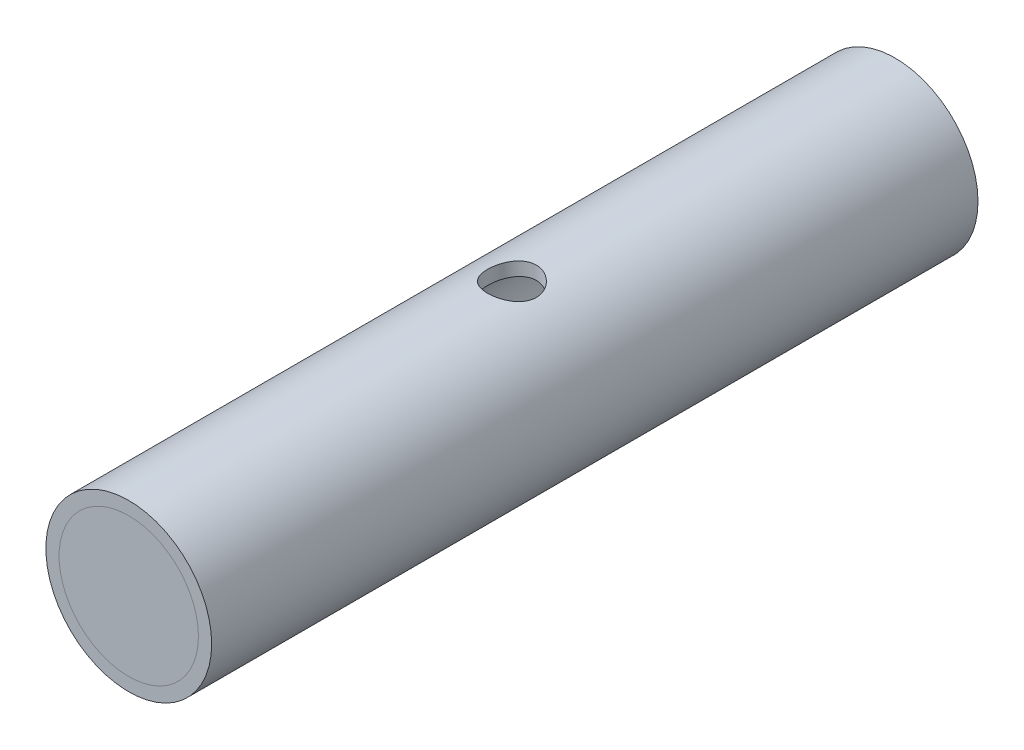
ISO-10303-21;
HEADER;
FILE_DESCRIPTION(('STEP AP214'),'2;1');
FILE_NAME('part.step','',(''),(''),'','','');
FILE_SCHEMA(('AUTOMOTIVE_DESIGN { 1 0 10303 214 1 1 1 1 }'));
ENDSEC;
DATA;
#1=APPLICATION_CONTEXT('core data for automotive mechanical design processes');
#2=APPLICATION_PROTOCOL_DEFINITION('international standard','automotive_design',2000,#1);
#3=PRODUCT_CONTEXT('',#1,'mechanical');
#4=PRODUCT('Part','Part','',(#3));
#5=PRODUCT_RELATED_PRODUCT_CATEGORY('part','',(#4));
#6=PRODUCT_DEFINITION_FORMATION('','',#4);
#7=PRODUCT_DEFINITION_CONTEXT('part definition',#1,'design');
#8=PRODUCT_DEFINITION('design','',#6,#7);
#9=PRODUCT_DEFINITION_SHAPE('','',#8);
#10=(LENGTH_UNIT() NAMED_UNIT(*) SI_UNIT(.MILLI.,.METRE.));
#11=(NAMED_UNIT(*) PLANE_ANGLE_UNIT() SI_UNIT($,.RADIAN.));
#12=(NAMED_UNIT(*) SI_UNIT($,.STERADIAN.) SOLID_ANGLE_UNIT());
#13=UNCERTAINTY_MEASURE_WITH_UNIT(LENGTH_MEASURE(1.E-05),#10,'distance_accuracy_value','');
#14=(GEOMETRIC_REPRESENTATION_CONTEXT(3) GLOBAL_UNCERTAINTY_ASSIGNED_CONTEXT((#13)) GLOBAL_UNIT_ASSIGNED_CONTEXT((#10,
#11,#12)) REPRESENTATION_CONTEXT('',''));
#15=CARTESIAN_POINT('',(0.,0.,0.));
#16=DIRECTION('',(0.,0.,1.));
#17=DIRECTION('',(1.,0.,0.));
#18=AXIS2_PLACEMENT_3D('',#15,#16,#17);
#19=CARTESIAN_POINT('',(0.,0.,-139.7));
#20=DIRECTION('',(0.,0.,1.));
#21=DIRECTION('',(1.,0.,0.));
#22=AXIS2_PLACEMENT_3D('',#19,#20,#21);
#23=PLANE('',#22);
#24=CARTESIAN_POINT('',(0.,0.,-139.7));
#25=DIRECTION('',(0.,0.,1.));
#26=DIRECTION('',(1.,0.,0.));
#27=AXIS2_PLACEMENT_3D('',#24,#25,#26);
#28=CIRCLE('',#27,25.4);
#29=CARTESIAN_POINT('',(25.4,0.,-139.7));
#30=VERTEX_POINT('',#29);
#31=EDGE_CURVE('E11',#30,#30,#28,.T.);
#32=ORIENTED_EDGE('',*,*,#31,.F.);
#33=EDGE_LOOP('',(#32));
#34=FACE_BOUND('',#33,.T.);
#35=ADVANCED_FACE('F45',(#34),#23,.F.);
#36=OPEN_SHELL('',(#35));
#37=SHELL_BASED_SURFACE_MODEL('B2',(#36));
#38=CARTESIAN_POINT('',(0.,0.,139.7));
#39=DIRECTION('',(0.,0.,1.));
#40=DIRECTION('',(1.,0.,0.));
#41=AXIS2_PLACEMENT_3D('',#38,#39,#40);
#42=PLANE('',#41);
#43=CARTESIAN_POINT('',(0.,0.,139.7));
#44=DIRECTION('',(0.,0.,1.));
#45=DIRECTION('',(1.,0.,0.));
#46=AXIS2_PLACEMENT_3D('',#43,#44,#45);
#47=CIRCLE('',#46,25.4);
#48=CARTESIAN_POINT('',(25.4,0.,139.7));
#49=VERTEX_POINT('',#48);
#50=EDGE_CURVE('E44',#49,#49,#47,.T.);
#51=ORIENTED_EDGE('',*,*,#50,.T.);
#52=EDGE_LOOP('',(#51));
#53=FACE_BOUND('',#52,.T.);
#54=ADVANCED_FACE('F70',(#53),#42,.T.);
#55=OPEN_SHELL('',(#54));
#56=SHELL_BASED_SURFACE_MODEL('B6',(#55));
#57=CARTESIAN_POINT('',(0.,0.,139.7));
#58=DIRECTION('',(0.,0.,-1.));
#59=DIRECTION('',(-1.,0.,0.));
#60=AXIS2_PLACEMENT_3D('',#57,#58,#59);
#61=CYLINDRICAL_SURFACE('',#60,30.226);
#62=CARTESIAN_POINT('',(0.,0.,139.7));
#63=DIRECTION('',(0.,0.,1.));
#64=DIRECTION('',(1.,0.,0.));
#65=AXIS2_PLACEMENT_3D('',#62,#63,#64);
#66=CIRCLE('',#65,30.226);
#67=CARTESIAN_POINT('',(30.226,0.,139.7));
#68=VERTEX_POINT('',#67);
#69=EDGE_CURVE('E69',#68,#68,#66,.T.);
#70=ORIENTED_EDGE('',*,*,#69,.F.);
#71=EDGE_LOOP('',(#70));
#72=FACE_BOUND('',#71,.T.);
#73=CARTESIAN_POINT('',(0.,0.,-139.7));
#74=DIRECTION('',(0.,0.,1.));
#75=DIRECTION('',(1.,0.,0.));
#76=AXIS2_PLACEMENT_3D('',#73,#74,#75);
#77=CIRCLE('',#76,30.226);
#78=CARTESIAN_POINT('',(30.226,0.,-139.7));
#79=VERTEX_POINT('',#78);
#80=EDGE_CURVE('E99',#79,#79,#77,.T.);
#81=ORIENTED_EDGE('',*,*,#80,.T.);
#82=EDGE_LOOP('',(#81));
#83=FACE_BOUND('',#82,.T.);
#84=CARTESIAN_POINT('',(0.,30.226,-8.89));
#85=CARTESIAN_POINT('',(0.244078706479912,30.2259996469876,-8.8899994428249));
#86=CARTESIAN_POINT('',(0.488167387654134,30.2230364699701,-8.87993976396791));
#87=CARTESIAN_POINT('',(0.97455598982904,30.2112645876433,-8.83979049136477));
#88=CARTESIAN_POINT('',(1.21685581274789,30.2024555641822,-8.80969980745906));
#89=CARTESIAN_POINT('',(1.69792260983485,30.1792334713529,-8.72975476642686));
#90=CARTESIAN_POINT('',(1.93668923426588,30.1648198510094,-8.67989846617793));
#91=CARTESIAN_POINT('',(2.40905708817351,30.1307752858961,-8.5608349553122));
#92=CARTESIAN_POINT('',(2.642656372997,30.111142411939,-8.49162058890068));
#93=CARTESIAN_POINT('',(3.10256853763941,30.0672315681266,-8.33457300681144));
#94=CARTESIAN_POINT('',(3.32889408019572,30.042962245951,-8.24677442111533));
#95=CARTESIAN_POINT('',(3.77330293959243,29.990387664788,-8.05313961246428));
#96=CARTESIAN_POINT('',(3.99138312088059,29.9620808895808,-7.94729661020325));
#97=CARTESIAN_POINT('',(4.4177585595968,29.902187586809,-7.71842189243786));
#98=CARTESIAN_POINT('',(4.62605700744133,29.8706021395618,-7.59539583413605));
#99=CARTESIAN_POINT('',(5.03176128322064,29.8049443588251,-7.33293112769926));
#100=CARTESIAN_POINT('',(5.22916205908566,29.7708708886305,-7.19348495964529));
#101=CARTESIAN_POINT('',(5.61656331398885,29.7002529351966,-6.89547090415772));
#102=CARTESIAN_POINT('',(5.80625628386527,29.6636680114812,-6.73651274297299));
#103=CARTESIAN_POINT('',(6.17158614178702,29.5898179182596,-6.40349071346725));
#104=CARTESIAN_POINT('',(6.34722892320604,29.5525530421013,-6.2294332431147));
#105=CARTESIAN_POINT('',(6.68353714076706,29.4783154913867,-5.86715866551885));
#106=CARTESIAN_POINT('',(6.84419410921452,29.4413429927062,-5.67893366018102));
#107=CARTESIAN_POINT('',(7.14931677644756,29.3687408118013,-5.28966028347711));
#108=CARTESIAN_POINT('',(7.29378848008797,29.3331106348434,-5.08861671162439));
#109=CARTESIAN_POINT('',(7.56861071639277,29.263420012929,-4.670354516169));
#110=CARTESIAN_POINT('',(7.69858197558977,29.2294111454195,-4.45287781877845));
#111=CARTESIAN_POINT('',(7.93962896840895,29.1648579438805,-4.00730885066998));
#112=CARTESIAN_POINT('',(8.05071207630933,29.1343122593206,-3.77922076733142));
#113=CARTESIAN_POINT('',(8.25314907578469,29.0776144871262,-3.31391052520422));
#114=CARTESIAN_POINT('',(8.34450246281639,29.0514625118547,-3.07668813300891));
#115=CARTESIAN_POINT('',(8.50668060363154,29.0043893315501,-2.59482218272546));
#116=CARTESIAN_POINT('',(8.57750605749935,28.9834679481362,-2.35017887803443));
#117=CARTESIAN_POINT('',(8.69634890089307,28.9480281625952,-1.86199183429746));
#118=CARTESIAN_POINT('',(8.74493072550874,28.9333520624647,-1.61859691092543));
#119=CARTESIAN_POINT('',(8.82159698086839,28.9100694160743,-1.12831123119266));
#120=CARTESIAN_POINT('',(8.84968174946794,28.9014627697708,-0.881420532521621));
#121=CARTESIAN_POINT('',(8.88508300299209,28.8905991693422,-0.386064842964374));
#122=CARTESIAN_POINT('',(8.89240366742803,28.8883409373746,-0.137600178987127));
#123=CARTESIAN_POINT('',(8.88621729725737,28.8902445472134,0.359042257596101));
#124=CARTESIAN_POINT('',(8.87271069032239,28.8944062571913,0.607220035988328));
#125=CARTESIAN_POINT('',(8.82583332459631,28.9087584068174,1.09278404914752));
#126=CARTESIAN_POINT('',(8.79316996174973,28.9187340776159,1.33024534915828));
#127=CARTESIAN_POINT('',(8.70883701542997,28.9442424771791,1.80155154360951));
#128=CARTESIAN_POINT('',(8.65716065024015,28.9597771887347,2.03539511659759));
#129=CARTESIAN_POINT('',(8.53525057637777,28.9959412540276,2.49774906986565));
#130=CARTESIAN_POINT('',(8.46501951874038,29.0165698799351,2.72626020695498));
#131=CARTESIAN_POINT('',(8.30655922248898,29.0623286163258,3.17649732891058));
#132=CARTESIAN_POINT('',(8.21832901198872,29.0874589698762,3.39822294664065));
#133=CARTESIAN_POINT('',(8.02325989862576,29.1418729451168,3.83636063428442));
#134=CARTESIAN_POINT('',(7.91619048736205,29.171207064159,4.05266376247001));
#135=CARTESIAN_POINT('',(7.68504145398429,29.2329525986027,4.47552255775782));
#136=CARTESIAN_POINT('',(7.56096136815434,29.2653640978871,4.68207795892776));
#137=CARTESIAN_POINT('',(7.29661542062856,29.3323894086294,5.08423208979507));
#138=CARTESIAN_POINT('',(7.15634660791665,29.3670036210987,5.2798288121696));
#139=CARTESIAN_POINT('',(6.86054325837309,29.4375123830306,5.65887305215183));
#140=CARTESIAN_POINT('',(6.70500830101903,29.4734069677452,5.84232023485412));
#141=CARTESIAN_POINT('',(6.37309948147162,29.5469915803686,6.20307678651097));
#142=CARTESIAN_POINT('',(6.19614005266523,29.5846958830333,6.37984497369451));
#143=CARTESIAN_POINT('',(5.82788473386927,29.6594357414022,6.7179116255409));
#144=CARTESIAN_POINT('',(5.63658880673348,29.6964712953733,6.87921005011872));
#145=CARTESIAN_POINT('',(5.24085978194455,29.768858235539,7.18526691140944));
#146=CARTESIAN_POINT('',(5.03642540015524,29.8042094565191,7.33002372751317));
#147=CARTESIAN_POINT('',(4.61576143173586,29.8722481575714,7.60194497599365));
#148=CARTESIAN_POINT('',(4.39953234469629,29.9049357503212,7.72911015269717));
#149=CARTESIAN_POINT('',(3.95525530679247,29.9669427009477,7.9656636880869));
#150=CARTESIAN_POINT('',(3.72713969660147,29.9962387958717,8.07493118427459));
#151=CARTESIAN_POINT('',(3.26206631148383,30.0503706287545,8.27375070109574));
#152=CARTESIAN_POINT('',(3.02511214884852,30.0752081653044,8.36331067508901));
#153=CARTESIAN_POINT('',(2.54398303202942,30.1197208813725,8.52199592177024));
#154=CARTESIAN_POINT('',(2.29980815740385,30.1393961177457,8.59112141951418));
#155=CARTESIAN_POINT('',(1.80606843050216,30.1730079252525,8.70830566479437));
#156=CARTESIAN_POINT('',(1.55650376707305,30.1869446971077,8.75636514918747));
#157=CARTESIAN_POINT('',(1.06261968213193,30.2082916354644,8.8296710562624));
#158=CARTESIAN_POINT('',(0.818417757186319,30.2159110364993,8.85564962120586));
#159=CARTESIAN_POINT('',(0.328590892209214,30.2252063849922,8.88731436901833));
#160=CARTESIAN_POINT('',(0.0829659851694474,30.2268824696974,8.89300102048285));
#161=CARTESIAN_POINT('',(-0.40784987281736,30.224244521121,8.88403052193145));
#162=CARTESIAN_POINT('',(-0.653040870736351,30.2199311816881,8.86937572838384));
#163=CARTESIAN_POINT('',(-1.1411968409233,30.2054361323306,8.81986142402252));
#164=CARTESIAN_POINT('',(-1.38416182792222,30.1952544612691,8.78500204701391));
#165=CARTESIAN_POINT('',(-1.86083203051031,30.169589165289,8.69637213218624));
#166=CARTESIAN_POINT('',(-2.09462365098016,30.1542259248426,8.64303029318015));
#167=CARTESIAN_POINT('',(-2.55686793973268,30.1185534203235,8.51773967757665));
#168=CARTESIAN_POINT('',(-2.78531866058363,30.0982423820557,8.44578422588438));
#169=CARTESIAN_POINT('',(-3.2352224337486,30.0532113739645,8.28387461512614));
#170=CARTESIAN_POINT('',(-3.45667746412433,30.0284926638052,8.19392559753113));
#171=CARTESIAN_POINT('',(-3.89133643186513,29.9752655168102,7.99666092040893));
#172=CARTESIAN_POINT('',(-4.10453716985472,29.9467556291252,7.88933860884483));
#173=CARTESIAN_POINT('',(-4.52590677767711,29.886009333503,7.65555975084611));
#174=CARTESIAN_POINT('',(-4.73386016838861,29.85370446917,7.52873261033239));
#175=CARTESIAN_POINT('',(-5.13849590409138,29.7867255225319,7.25859255660919));
#176=CARTESIAN_POINT('',(-5.33517312906508,29.7520503794079,7.11527224200254));
#177=CARTESIAN_POINT('',(-5.7159635149058,29.6812457002579,6.81314399520717));
#178=CARTESIAN_POINT('',(-5.90007679207984,29.6451161777003,6.6543362064222));
#179=CARTESIAN_POINT('',(-6.25463251854174,29.5723419371038,6.32223659129286));
#180=CARTESIAN_POINT('',(-6.4250747193106,29.5356972097136,6.14894450176321));
#181=CARTESIAN_POINT('',(-6.75696661742502,29.4615749720045,5.78262113048179));
#182=CARTESIAN_POINT('',(-6.917891650935,29.4241132980724,5.58911084793865));
#183=CARTESIAN_POINT('',(-7.22283084055437,29.3507475815498,5.18903219372249));
#184=CARTESIAN_POINT('',(-7.36685115519356,29.3148429747312,4.9824686199264));
#185=CARTESIAN_POINT('',(-7.63707984287791,29.2456074904237,4.55747134911744));
#186=CARTESIAN_POINT('',(-7.76328126495719,29.212277619596,4.33903306567023));
#187=CARTESIAN_POINT('',(-7.9968003514047,29.149217661518,3.89189807597559));
#188=CARTESIAN_POINT('',(-8.10412578091448,29.1194860955864,3.66320563686504));
#189=CARTESIAN_POINT('',(-8.29861808844121,29.0646551949032,3.19816412733975));
#190=CARTESIAN_POINT('',(-8.38587905379894,29.0395343561179,2.96185697437128));
#191=CARTESIAN_POINT('',(-8.54014663565491,28.9945414818076,2.48222737104045));
#192=CARTESIAN_POINT('',(-8.60715324622509,28.9746694478189,2.23890491862487));
#193=CARTESIAN_POINT('',(-8.72028277188292,28.9408229962171,1.74711578424973));
#194=CARTESIAN_POINT('',(-8.7664113902741,28.9268469680454,1.49865052658366));
#195=CARTESIAN_POINT('',(-8.8373668942041,28.9052487411391,0.998425786102343));
#196=CARTESIAN_POINT('',(-8.86219455076498,28.8976263124262,0.746666422857382));
#197=CARTESIAN_POINT('',(-8.88974195465115,28.8891633127108,0.251958860700056));
#198=CARTESIAN_POINT('',(-8.89330769628549,28.8880632331827,0.00906182099380927));
#199=CARTESIAN_POINT('',(-8.88055579708614,28.8919859232674,-0.476155515219273));
#200=CARTESIAN_POINT('',(-8.86423871478479,28.8970085208868,-0.718475827735477));
#201=CARTESIAN_POINT('',(-8.8118730618851,28.9130198172743,-1.20076164026306));
#202=CARTESIAN_POINT('',(-8.7758253365073,28.9240082604776,-1.44072724069731));
#203=CARTESIAN_POINT('',(-8.68432270563806,28.9516129832692,-1.91659763878378));
#204=CARTESIAN_POINT('',(-8.62886770733465,28.9682292897718,-2.15250241701016));
#205=CARTESIAN_POINT('',(-8.49978992758467,29.0063633559375,-2.61588258729795));
#206=CARTESIAN_POINT('',(-8.42638725512145,29.0278215063077,-2.84342430339863));
#207=CARTESIAN_POINT('',(-8.26165142611859,29.0751359827725,-3.29153820520311));
#208=CARTESIAN_POINT('',(-8.1703118460547,29.1009938840516,-3.51210786113927));
#209=CARTESIAN_POINT('',(-7.97041080925797,29.1563779786197,-3.94479982002137));
#210=CARTESIAN_POINT('',(-7.86185034442111,29.1859039606118,-4.15692260861382));
#211=CARTESIAN_POINT('',(-7.62826213845604,29.247825333984,-4.57146872475367));
#212=CARTESIAN_POINT('',(-7.50323343985708,29.2802208921668,-4.77389148740309));
#213=CARTESIAN_POINT('',(-7.23286117469694,29.3482009035,-5.17477601973064));
#214=CARTESIAN_POINT('',(-7.08695786849174,29.3838574325532,-5.37284822927006));
#215=CARTESIAN_POINT('',(-6.77936450740341,29.4563448764872,-5.75610067742786));
#216=CARTESIAN_POINT('',(-6.61767412950644,29.4931758153869,-5.9412806521298));
#217=CARTESIAN_POINT('',(-6.27949627694084,29.5670248235009,-6.29764885621711));
#218=CARTESIAN_POINT('',(-6.10300506223222,29.6040429377787,-6.46883352740131));
#219=CARTESIAN_POINT('',(-5.73636337559087,29.6772665872085,-6.79607336987705));
#220=CARTESIAN_POINT('',(-5.54621315315061,29.7134721371869,-6.95212881739343));
#221=CARTESIAN_POINT('',(-5.14791894750998,29.7850982086146,-7.25223620730231));
#222=CARTESIAN_POINT('',(-4.9394203096772,29.8204683996658,-7.39582996629549));
#223=CARTESIAN_POINT('',(-4.51067392816381,29.8883251144409,-7.66485125686286));
#224=CARTESIAN_POINT('',(-4.29043049364585,29.9208126843012,-7.79028538929844));
#225=CARTESIAN_POINT('',(-3.83966688283158,29.9819904289941,-8.02204893102891));
#226=CARTESIAN_POINT('',(-3.60914909312285,30.0106814796222,-8.12838274848758));
#227=CARTESIAN_POINT('',(-3.13941870197074,30.0634488654799,-8.32109240173994));
#228=CARTESIAN_POINT('',(-2.90020700459871,30.0875256789153,-8.40747030589706));
#229=CARTESIAN_POINT('',(-2.4434211158612,30.1278441129275,-8.55056411707888));
#230=CARTESIAN_POINT('',(-2.2266145222584,30.1446744215742,-8.60957474760697));
#231=CARTESIAN_POINT('',(-1.78878870356977,30.1738205938962,-8.71107584452359));
#232=CARTESIAN_POINT('',(-1.56776818885476,30.1861350514291,-8.753561165523));
#233=CARTESIAN_POINT('',(-1.12295612449701,30.2059530617643,-8.82166010393837));
#234=CARTESIAN_POINT('',(-0.899164920398878,30.2134572084417,-8.84727580406777));
#235=CARTESIAN_POINT('',(-0.45025165590039,30.2234799980885,-8.88144312616897));
#236=CARTESIAN_POINT('',(-0.225130070987301,30.2260003256068,-8.89000051391975));
#237=CARTESIAN_POINT('',(0.,30.226,-8.89));
#238=B_SPLINE_CURVE_WITH_KNOTS('',3,(#84,#85,#86,#87,#88,#89,#90,#91,#92,#93,#94,#95,#96,#97,
#98,#99,#100,#101,#102,#103,#104,#105,#106,#107,#108,#109,#110,#111,#112,#113,#114,#115,#116,
#117,#118,#119,#120,#121,#122,#123,#124,#125,#126,#127,#128,#129,#130,#131,#132,#133,#134,#135,
#136,#137,#138,#139,#140,#141,#142,#143,#144,#145,#146,#147,#148,#149,#150,#151,#152,#153,#154,
#155,#156,#157,#158,#159,#160,#161,#162,#163,#164,#165,#166,#167,#168,#169,#170,#171,#172,#173,
#174,#175,#176,#177,#178,#179,#180,#181,#182,#183,#184,#185,#186,#187,#188,#189,#190,#191,#192,
#193,#194,#195,#196,#197,#198,#199,#200,#201,#202,#203,#204,#205,#206,#207,#208,#209,#210,#211,
#212,#213,#214,#215,#216,#217,#218,#219,#220,#221,#222,#223,#224,#225,#226,#227,#228,#229,#230,
#231,#232,#233,#234,#235,#236,#237),.UNSPECIFIED.,.T.,.F.,(4,2,2,2,2,2,2,2,2,2,2,2,2,2,2,2,2,2,
2,2,2,2,2,2,2,2,2,2,2,2,2,2,2,2,2,2,2,2,2,2,2,2,2,2,2,2,2,2,2,2,2,2,2,2,2,2,2,2,2,2,2,2,2,2,2,2,
2,2,2,2,2,2,2,2,2,2,4),(0.,0.732029116388138,1.46409807569938,2.19623902125549,2.92865096446526,
3.65970995467328,4.39104421223776,5.12213825664933,5.85356843208124,6.60324733583172,
7.3526101184803,8.1023937936703,8.85189836576199,9.61784382824925,10.3834895616184,
11.1491548723388,11.9147940677462,12.6597509573845,13.4046955675267,14.1494902205382,
14.8942695799808,15.6131389798596,16.332265041063,17.0512884113462,17.7703506164558,
18.4989153488715,19.2274999461236,19.9562175662474,20.68495526532,21.4429178113364,
22.2008823213207,22.9589210268095,23.7169276488077,24.4798589907271,25.2424818696414,
26.0050963490633,26.7676841512706,27.5038729056716,28.2400446593604,28.9761311378565,
29.712212741666,30.4322524884544,31.1525508101304,31.872643607423,32.5930127750596,
33.3293093492264,34.06593763832,34.8025591073711,35.5391939640269,36.3016509651392,
37.0638293289829,37.826304194128,38.5884646575372,39.3469747562069,40.1054850768776,
40.8637880677715,41.6220636095297,42.3499552842775,43.0778265121479,43.8056665619384,
44.5335100925475,45.2528395482285,45.9724270798541,46.691973179405,47.4115611321817,
48.1564518310487,48.9013577740633,49.646452518668,50.3915336569932,51.1574676474499,
51.923122524964,52.6886004692291,53.4539990386454,54.1292999722274,54.804811002323,
55.4802386185824,56.1554378988228),.UNSPECIFIED.);
#239=CARTESIAN_POINT('',(0.,30.226,-8.89));
#240=VERTEX_POINT('',#239);
#241=EDGE_CURVE('E111',#240,#240,#238,.T.);
#242=ORIENTED_EDGE('',*,*,#241,.T.);
#243=EDGE_LOOP('',(#242));
#244=FACE_BOUND('',#243,.T.);
#245=ADVANCED_FACE('F88',(#72,#83,#244),#61,.T.);
#246=CARTESIAN_POINT('',(0.,0.,139.7));
#247=DIRECTION('',(0.,0.,-1.));
#248=DIRECTION('',(-1.,0.,0.));
#249=AXIS2_PLACEMENT_3D('',#246,#247,#248);
#250=CYLINDRICAL_SURFACE('',#249,25.4);
#251=CARTESIAN_POINT('',(0.,0.,-139.7));
#252=DIRECTION('',(0.,0.,1.));
#253=DIRECTION('',(1.,0.,0.));
#254=AXIS2_PLACEMENT_3D('',#251,#252,#253);
#255=CIRCLE('',#254,25.4);
#256=CARTESIAN_POINT('',(25.4,0.,-139.7));
#257=VERTEX_POINT('',#256);
#258=EDGE_CURVE('E106',#257,#257,#255,.T.);
#259=ORIENTED_EDGE('',*,*,#258,.F.);
#260=EDGE_LOOP('',(#259));
#261=FACE_BOUND('',#260,.T.);
#262=CARTESIAN_POINT('',(0.,0.,139.7));
#263=DIRECTION('',(0.,0.,1.));
#264=DIRECTION('',(1.,0.,0.));
#265=AXIS2_PLACEMENT_3D('',#262,#263,#264);
#266=CIRCLE('',#265,25.4);
#267=CARTESIAN_POINT('',(25.4,0.,139.7));
#268=VERTEX_POINT('',#267);
#269=EDGE_CURVE('E104',#268,#268,#266,.T.);
#270=ORIENTED_EDGE('',*,*,#269,.T.);
#271=EDGE_LOOP('',(#270));
#272=FACE_BOUND('',#271,.T.);
#273=CARTESIAN_POINT('',(0.,25.4,-8.89));
#274=CARTESIAN_POINT('',(-0.24182836127676,25.4000003228687,-8.89000046066678));
#275=CARTESIAN_POINT('',(-0.483649910766547,25.3965386751855,-8.88012480972059));
#276=CARTESIAN_POINT('',(-0.965483039129618,25.3827879616841,-8.84072205756583));
#277=CARTESIAN_POINT('',(-1.20549468558075,25.3724991520666,-8.8111956937832));
#278=CARTESIAN_POINT('',(-1.68194910026183,25.3453741117162,-8.73277957937956));
#279=CARTESIAN_POINT('',(-1.91839191607314,25.3285379683557,-8.68389008715417));
#280=CARTESIAN_POINT('',(-2.38603889349826,25.2887700932736,-8.56720481739291));
#281=CARTESIAN_POINT('',(-2.61724297957594,25.2658382737203,-8.49940876743478));
#282=CARTESIAN_POINT('',(-3.0723826494721,25.2145357382167,-8.34566648981001));
#283=CARTESIAN_POINT('',(-3.29633190472679,25.1861760434604,-8.25975700579726));
#284=CARTESIAN_POINT('',(-3.73609519702151,25.124707163568,-8.07037982977754));
#285=CARTESIAN_POINT('',(-3.9519061844539,25.0915962199228,-7.96690563419961));
#286=CARTESIAN_POINT('',(-4.37398916001867,25.0214706063928,-7.74321424806668));
#287=CARTESIAN_POINT('',(-4.58026146881424,24.9844560678731,-7.62299762089035));
#288=CARTESIAN_POINT('',(-4.98209472134935,24.9074405095819,-7.36665694795064));
#289=CARTESIAN_POINT('',(-5.17765498194656,24.8674392997241,-7.23053188938523));
#290=CARTESIAN_POINT('',(-5.56341369095874,24.784040913989,-6.93837452809234));
#291=CARTESIAN_POINT('',(-5.75320395213842,24.7405745232637,-6.78182284355986));
#292=CARTESIAN_POINT('',(-6.11904149675278,24.6526414886776,-6.45366687164949));
#293=CARTESIAN_POINT('',(-6.29508853312742,24.6081748268536,-6.28206231378591));
#294=CARTESIAN_POINT('',(-6.63243852095564,24.519404436464,-5.92479822732127));
#295=CARTESIAN_POINT('',(-6.79373765949196,24.4751007528603,-5.73913508657304));
#296=CARTESIAN_POINT('',(-7.10053992515739,24.3878611958871,-5.35489260406743));
#297=CARTESIAN_POINT('',(-7.24604344780902,24.3449252882875,-5.15631358592307));
#298=CARTESIAN_POINT('',(-7.52477666145232,24.2602482596366,-4.74072321063943));
#299=CARTESIAN_POINT('',(-7.65745167312731,24.2185917039722,-4.52332202199023));
#300=CARTESIAN_POINT('',(-7.90387858032243,24.1392928728523,-4.07745705638203));
#301=CARTESIAN_POINT('',(-8.01763799103598,24.1016490052944,-3.84899771964204));
#302=CARTESIAN_POINT('',(-8.22533529974016,24.0315600989627,-3.38247645065934));
#303=CARTESIAN_POINT('',(-8.31927427082587,23.9991147787582,-3.14441503911262));
#304=CARTESIAN_POINT('',(-8.48646055694893,23.9405063805822,-2.66038270925555));
#305=CARTESIAN_POINT('',(-8.5597089108455,23.9143429872101,-2.41441218874614));
#306=CARTESIAN_POINT('',(-8.68248344274812,23.8700353031105,-1.92555221296121));
#307=CARTESIAN_POINT('',(-8.73277986901461,23.8516325150532,-1.68287959449671));
#308=CARTESIAN_POINT('',(-8.81297254646513,23.8221188810588,-1.19374554183842));
#309=CARTESIAN_POINT('',(-8.84286926059784,23.8110078696431,-0.947284193755405));
#310=CARTESIAN_POINT('',(-8.88193828675368,23.7964621052267,-0.452572018250616));
#311=CARTESIAN_POINT('',(-8.89111681440155,23.7930250499799,-0.204321749947242));
#312=CARTESIAN_POINT('',(-8.88866671739678,23.7939405768778,0.292057504998741));
#313=CARTESIAN_POINT('',(-8.87703876086258,23.7982929088968,0.540186495279796));
#314=CARTESIAN_POINT('',(-8.83423484632625,23.8142137466371,1.02165481790422));
#315=CARTESIAN_POINT('',(-8.80409277306774,23.825400434615,1.25509961868142));
#316=CARTESIAN_POINT('',(-8.72547605988569,23.8543040164729,1.71855411648044));
#317=CARTESIAN_POINT('',(-8.67699497569773,23.8720232057953,1.94856257641647));
#318=CARTESIAN_POINT('',(-8.56215904396402,23.9134512471228,2.40344485562842));
#319=CARTESIAN_POINT('',(-8.4958092116553,23.9371584183601,2.62832009646765));
#320=CARTESIAN_POINT('',(-8.345766652109,23.9898832431993,3.07165555571933));
#321=CARTESIAN_POINT('',(-8.26206731960872,24.0189029188729,3.29011329460321));
#322=CARTESIAN_POINT('',(-8.07644310233061,24.0819606875936,3.72283849180864));
#323=CARTESIAN_POINT('',(-7.97423447133549,24.1160752091097,3.93697301133352));
#324=CARTESIAN_POINT('',(-7.75329966938953,24.1880102273709,4.35598001285756));
#325=CARTESIAN_POINT('',(-7.63456786619877,24.2258319864938,4.56084930494186));
#326=CARTESIAN_POINT('',(-7.38140498168582,24.3041645048159,4.96012540526309));
#327=CARTESIAN_POINT('',(-7.24697254199541,24.3446754965478,5.15453130611257));
#328=CARTESIAN_POINT('',(-6.96325053839514,24.4273406603556,5.5318132515891));
#329=CARTESIAN_POINT('',(-6.81396039275777,24.4694948967305,5.7146888443088));
#330=CARTESIAN_POINT('',(-6.49229083591047,24.5568629733031,6.07820163967571));
#331=CARTESIAN_POINT('',(-6.31907346110122,24.6021121444069,6.25808974216942));
#332=CARTESIAN_POINT('',(-5.95810424454161,24.6920143575725,6.60267647095273));
#333=CARTESIAN_POINT('',(-5.7703569355752,24.7366675804914,6.76737979945686));
#334=CARTESIAN_POINT('',(-5.38131687778199,24.8242058093451,7.08067317463898));
#335=CARTESIAN_POINT('',(-5.1800174503464,24.8670899264097,7.22925518098298));
#336=CARTESIAN_POINT('',(-4.76526877459592,24.9498879216856,7.50911928552187));
#337=CARTESIAN_POINT('',(-4.55182439765147,24.9898029761785,7.64040825092488));
#338=CARTESIAN_POINT('',(-4.11133665081266,25.066062294242,7.88628006939207));
#339=CARTESIAN_POINT('',(-3.8841574552371,25.1023561331244,8.00063553790658));
#340=CARTESIAN_POINT('',(-3.42028129129789,25.1697551674433,8.20965670536595));
#341=CARTESIAN_POINT('',(-3.18358833273178,25.2008625209675,8.30433059784984));
#342=CARTESIAN_POINT('',(-2.70231577010806,25.2570024059238,8.47317019639736));
#343=CARTESIAN_POINT('',(-2.45773692595574,25.2820355207157,8.54733787193962));
#344=CARTESIAN_POINT('',(-1.96253480644617,25.3252880383655,8.67443897636092));
#345=CARTESIAN_POINT('',(-1.7119118418047,25.3435077906929,8.72737349433645));
#346=CARTESIAN_POINT('',(-1.21856085419909,25.3718988595058,8.80946988267054));
#347=CARTESIAN_POINT('',(-0.976019201388801,25.3824097376397,8.83963668204542));
#348=CARTESIAN_POINT('',(-0.489076510216546,25.3964588452306,8.87989758260712));
#349=CARTESIAN_POINT('',(-0.244675530714951,25.399997294498,8.88999231657934));
#350=CARTESIAN_POINT('',(0.244084729546523,25.4000027020732,8.89000767363187));
#351=CARTESIAN_POINT('',(0.488444010441736,25.3964708433876,8.87993167168757));
#352=CARTESIAN_POINT('',(0.975300924814962,25.3824366947288,8.83971422670889));
#353=CARTESIAN_POINT('',(1.21779858050512,25.3719344880541,8.80957302346173));
#354=CARTESIAN_POINT('',(1.69121613557356,25.3447067158221,8.73084022637263));
#355=CARTESIAN_POINT('',(1.92225490463188,25.3281965624366,8.68288619494138));
#356=CARTESIAN_POINT('',(2.3794116197627,25.2893464945036,8.56889820899747));
#357=CARTESIAN_POINT('',(2.60552779193171,25.2670045148806,8.50285784962736));
#358=CARTESIAN_POINT('',(3.05122307878095,25.2170639583819,8.35328552874066));
#359=CARTESIAN_POINT('',(3.27080400775923,25.1894668564608,8.26975847456052));
#360=CARTESIAN_POINT('',(3.70222474223599,25.1296832761152,8.08582986894795));
#361=CARTESIAN_POINT('',(3.91406157862406,25.0974950601527,7.98542192624749));
#362=CARTESIAN_POINT('',(4.33433601334893,25.0283861807437,7.76552655216419));
#363=CARTESIAN_POINT('',(4.54252287397827,24.9913602993818,7.64559303050845));
#364=CARTESIAN_POINT('',(4.94817757016623,24.9142165943069,7.38953267861459));
#365=CARTESIAN_POINT('',(5.14564168045934,24.874097707597,7.2534002723674));
#366=CARTESIAN_POINT('',(5.52868238891824,24.7917739314876,6.9658544782867));
#367=CARTESIAN_POINT('',(5.71425758237119,24.7495687966313,6.8144392901679));
#368=CARTESIAN_POINT('',(6.07246591542535,24.6641251473516,6.49726793267772));
#369=CARTESIAN_POINT('',(6.24509866521659,24.620886601855,6.33151133168481));
#370=CARTESIAN_POINT('',(6.58483651179129,24.5322703529644,5.97788789061661));
#371=CARTESIAN_POINT('',(6.75122048291735,24.4868950584648,5.7893268026792));
#372=CARTESIAN_POINT('',(7.06750806840006,24.3974863043549,5.39866413540737));
#373=CARTESIAN_POINT('',(7.2174170670032,24.3534524097777,5.19656701479391));
#374=CARTESIAN_POINT('',(7.49985818734934,24.2679606620271,4.7799157871424));
#375=CARTESIAN_POINT('',(7.63238252053396,24.2265039678195,4.56535615842288));
#376=CARTESIAN_POINT('',(7.87893496742905,24.1474459410819,4.12529570442282));
#377=CARTESIAN_POINT('',(7.99297082473854,24.1098429969114,3.89979951142456));
#378=CARTESIAN_POINT('',(8.20173163791441,24.0396285698582,3.43913856970451));
#379=CARTESIAN_POINT('',(8.29644671668867,24.0070196421091,3.20396894921907));
#380=CARTESIAN_POINT('',(8.46559774464417,23.9478952831017,2.72580891279483));
#381=CARTESIAN_POINT('',(8.54004250954482,23.9213772036729,2.48282194825808));
#382=CARTESIAN_POINT('',(8.66795623370348,23.875325394405,1.99078724971406));
#383=CARTESIAN_POINT('',(8.72142958633079,23.8557902017742,1.74174079675165));
#384=CARTESIAN_POINT('',(8.80684895534407,23.8243886084327,1.23950917039701));
#385=CARTESIAN_POINT('',(8.8387962110462,23.8125217662359,0.986324236128201));
#386=CARTESIAN_POINT('',(8.87962241707451,23.7973264159497,0.492272408418115));
#387=CARTESIAN_POINT('',(8.88970267173595,23.7935534002801,0.251517715589925));
#388=CARTESIAN_POINT('',(8.89028432379948,23.7933362064393,-0.23001332013789));
#389=CARTESIAN_POINT('',(8.8807864931642,23.7968917393039,-0.470789661809579));
#390=CARTESIAN_POINT('',(8.84231184142958,23.8112145601791,-0.950542608328767));
#391=CARTESIAN_POINT('',(8.81333643460381,23.8219813245797,-1.1895193425725));
#392=CARTESIAN_POINT('',(8.73619856388598,23.8503777668466,-1.66393844348224));
#393=CARTESIAN_POINT('',(8.68803606226916,23.8680074582066,-1.89938080319818));
#394=CARTESIAN_POINT('',(8.57433202644246,23.9090859074155,-2.35961897797444));
#395=CARTESIAN_POINT('',(8.50922313637722,23.9323889801715,-2.58453501079215));
#396=CARTESIAN_POINT('',(8.36167508714692,23.9843387162895,-3.0280573616841));
#397=CARTESIAN_POINT('',(8.27922978077695,24.0129872746647,-3.24666141027998));
#398=CARTESIAN_POINT('',(8.09768868010847,24.0748130685541,-3.67612283653873));
#399=CARTESIAN_POINT('',(7.9985959703219,24.1079894649152,-3.88698164047437));
#400=CARTESIAN_POINT('',(7.78442314190305,24.1779951238205,-4.29988025615374));
#401=CARTESIAN_POINT('',(7.66933684070769,24.214825797398,-4.50191661756557));
#402=CARTESIAN_POINT('',(7.41821286470413,24.2929661492734,-4.90522757128897));
#403=CARTESIAN_POINT('',(7.28144658984322,24.3344047914034,-5.1060237294263));
#404=CARTESIAN_POINT('',(6.99209466758942,24.4191183630589,-5.49559973059913));
#405=CARTESIAN_POINT('',(6.83950184292963,24.4623941204062,-5.68437405860483));
#406=CARTESIAN_POINT('',(6.51947673745576,24.5496216643878,-6.04874535989732));
#407=CARTESIAN_POINT('',(6.35204365352524,24.5935734875026,-6.2243416190703));
#408=CARTESIAN_POINT('',(6.00332687565089,24.681012447743,-6.56132297401309));
#409=CARTESIAN_POINT('',(5.82204302636961,24.7244995796508,-6.72270791035806));
#410=CARTESIAN_POINT('',(5.43822219019726,24.8118153917452,-7.03719563293613));
#411=CARTESIAN_POINT('',(5.23509634042357,24.8555716888811,-7.18960088975947));
#412=CARTESIAN_POINT('',(4.81620777720884,24.9401237631154,-7.47667626377719));
#413=CARTESIAN_POINT('',(4.6004498828451,24.9809206560866,-7.61135308142622));
#414=CARTESIAN_POINT('',(4.15754600679559,25.0584389323619,-7.86204047024087));
#415=CARTESIAN_POINT('',(3.93039630915821,25.0951589730976,-7.97804489793319));
#416=CARTESIAN_POINT('',(3.46641787918533,25.1634436724624,-8.19030504507581));
#417=CARTESIAN_POINT('',(3.22959346140265,25.1950105984704,-8.28656945496832));
#418=CARTESIAN_POINT('',(2.75042872119641,25.2517865389248,-8.45761586663341));
#419=CARTESIAN_POINT('',(2.50817343631992,25.2770593784334,-8.53261469067966));
#420=CARTESIAN_POINT('',(2.01756569313618,25.3209414252771,-8.66174733098737));
#421=CARTESIAN_POINT('',(1.76921324788717,25.3395506468822,-8.71588119193108));
#422=CARTESIAN_POINT('',(1.26843027645447,25.3695483578735,-8.80271241113053));
#423=CARTESIAN_POINT('',(1.01600097541154,25.3809389765993,-8.83541609094654));
#424=CARTESIAN_POINT('',(0.509045208017842,25.3961644671713,-8.87905918039574));
#425=CARTESIAN_POINT('',(0.254518831272742,25.3999996601881,-8.88999951515873));
#426=CARTESIAN_POINT('',(0.,25.4,-8.89));
#427=B_SPLINE_CURVE_WITH_KNOTS('',3,(#273,#274,#275,#276,#277,#278,#279,#280,#281,#282,#283,
#284,#285,#286,#287,#288,#289,#290,#291,#292,#293,#294,#295,#296,#297,#298,#299,#300,#301,#302,
#303,#304,#305,#306,#307,#308,#309,#310,#311,#312,#313,#314,#315,#316,#317,#318,#319,#320,#321,
#322,#323,#324,#325,#326,#327,#328,#329,#330,#331,#332,#333,#334,#335,#336,#337,#338,#339,#340,
#341,#342,#343,#344,#345,#346,#347,#348,#349,#350,#351,#352,#353,#354,#355,#356,#357,#358,#359,
#360,#361,#362,#363,#364,#365,#366,#367,#368,#369,#370,#371,#372,#373,#374,#375,#376,#377,#378,
#379,#380,#381,#382,#383,#384,#385,#386,#387,#388,#389,#390,#391,#392,#393,#394,#395,#396,#397,
#398,#399,#400,#401,#402,#403,#404,#405,#406,#407,#408,#409,#410,#411,#412,#413,#414,#415,#416,
#417,#418,#419,#420,#421,#422,#423,#424,#425,#426),.UNSPECIFIED.,.T.,.F.,(4,2,2,2,2,2,2,2,2,2,2,
2,2,2,2,2,2,2,2,2,2,2,2,2,2,2,2,2,2,2,2,2,2,2,2,2,2,2,2,2,2,2,2,2,2,2,2,2,2,2,2,2,2,2,2,2,2,2,2,
2,2,2,2,2,2,2,2,2,2,2,2,2,2,2,2,2,4),(0.,0.725248076073211,1.45046893753137,2.17568012144274,
2.90090175537285,3.62466617038515,4.34869915579662,5.07270778356234,5.79676253009773,
6.54542807364494,7.29410707275012,8.04297909098752,8.79183235312835,9.5650953780308,
10.3380504466159,11.1109636560272,11.8838380511877,12.6284194684415,13.3729839876901,
14.1173251018113,14.8616423147729,15.567759149235,16.274124341534,16.9802914839496,
17.6867279721626,18.4050867098266,19.1236909163606,19.8423573403229,20.5610519134907,
21.3215556370373,22.0818230615009,22.8424679348336,23.6028098333,24.372581562099,25.14203218647,
25.9114088848017,26.6807461150219,27.4137382665369,28.1467073096134,28.8795537222745,
29.6123913772832,30.3211933029792,31.0302465598821,31.7391010994261,32.4482246250605,
33.1767100010375,33.9054468669235,34.6342696771634,35.3631144298093,36.1288204827475,
36.8942755436042,37.6600723756291,38.4255476327937,39.1914132378804,39.9569452280227,
40.722316758604,41.4876442208914,42.2097334855602,42.931794278841,43.6538026486997,
44.3758124381445,45.0809418018606,45.7863216156116,46.491570877011,47.197093525403,
47.9356445041481,48.6745318890529,49.4134592850752,50.1523949694447,50.9245188332014,
51.6963500300949,52.4684346532871,53.2401786369381,54.0037451108046,54.7673099494873,
55.5306494472538,56.2939564958167),.UNSPECIFIED.);
#428=CARTESIAN_POINT('',(0.,25.4,-8.89));
#429=VERTEX_POINT('',#428);
#430=EDGE_CURVE('E91',#429,#429,#427,.T.);
#431=ORIENTED_EDGE('',*,*,#430,.T.);
#432=EDGE_LOOP('',(#431));
#433=FACE_BOUND('',#432,.T.);
#434=ADVANCED_FACE('F119',(#261,#272,#433),#250,.F.);
#435=CARTESIAN_POINT('',(0.,0.,139.7));
#436=DIRECTION('',(0.,0.,1.));
#437=DIRECTION('',(1.,0.,0.));
#438=AXIS2_PLACEMENT_3D('',#435,#436,#437);
#439=PLANE('',#438);
#440=ORIENTED_EDGE('',*,*,#69,.T.);
#441=EDGE_LOOP('',(#440));
#442=FACE_BOUND('',#441,.T.);
#443=ORIENTED_EDGE('',*,*,#269,.F.);
#444=EDGE_LOOP('',(#443));
#445=FACE_BOUND('',#444,.T.);
#446=ADVANCED_FACE('F123',(#442,#445),#439,.T.);
#447=CARTESIAN_POINT('',(0.,0.,-139.7));
#448=DIRECTION('',(0.,0.,1.));
#449=DIRECTION('',(1.,0.,0.));
#450=AXIS2_PLACEMENT_3D('',#447,#448,#449);
#451=PLANE('',#450);
#452=ORIENTED_EDGE('',*,*,#80,.F.);
#453=EDGE_LOOP('',(#452));
#454=FACE_BOUND('',#453,.T.);
#455=ORIENTED_EDGE('',*,*,#258,.T.);
#456=EDGE_LOOP('',(#455));
#457=FACE_BOUND('',#456,.T.);
#458=ADVANCED_FACE('F126',(#454,#457),#451,.F.);
#459=CARTESIAN_POINT('',(0.,30.227,0.));
#460=DIRECTION('',(0.,-1.,0.));
#461=DIRECTION('',(0.,0.,-1.));
#462=AXIS2_PLACEMENT_3D('',#459,#460,#461);
#463=CYLINDRICAL_SURFACE('',#462,8.89);
#464=ORIENTED_EDGE('',*,*,#430,.F.);
#465=EDGE_LOOP('',(#464));
#466=FACE_BOUND('',#465,.T.);
#467=ORIENTED_EDGE('',*,*,#241,.F.);
#468=EDGE_LOOP('',(#467));
#469=FACE_BOUND('',#468,.T.);
#470=ADVANCED_FACE('F116',(#466,#469),#463,.F.);
#471=CLOSED_SHELL('',(#245,#434,#446,#458,#470));
#472=MANIFOLD_SOLID_BREP('B39',#471);
#473=ADVANCED_BREP_SHAPE_REPRESENTATION('',(#18,#472),#14);
#474=MANIFOLD_SURFACE_SHAPE_REPRESENTATION('',(#18,#37,#56),#14);
#475=SHAPE_REPRESENTATION('',(#18),#14);
#476=SHAPE_DEFINITION_REPRESENTATION(#9,#475);
#477=SHAPE_REPRESENTATION_RELATIONSHIP('','',#475,#473);
#478=SHAPE_REPRESENTATION_RELATIONSHIP('','',#475,#474);
ENDSEC;
END-ISO-10303-21;
